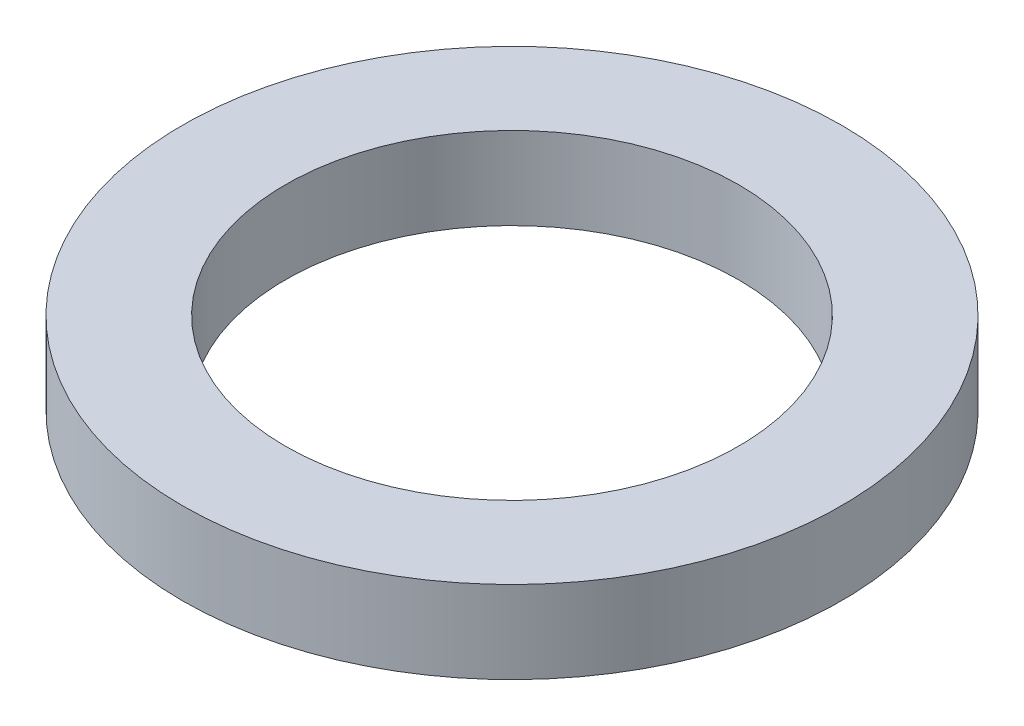
ISO-10303-21;
HEADER;
FILE_DESCRIPTION(('STEP AP214'),'2;1');
FILE_NAME('part.step','',(''),(''),'','','');
FILE_SCHEMA(('AUTOMOTIVE_DESIGN { 1 0 10303 214 1 1 1 1 }'));
ENDSEC;
DATA;
#1=APPLICATION_CONTEXT('core data for automotive mechanical design processes');
#2=APPLICATION_PROTOCOL_DEFINITION('international standard','automotive_design',2000,#1);
#3=PRODUCT_CONTEXT('',#1,'mechanical');
#4=PRODUCT('Part','Part','',(#3));
#5=PRODUCT_RELATED_PRODUCT_CATEGORY('part','',(#4));
#6=PRODUCT_DEFINITION_FORMATION('','',#4);
#7=PRODUCT_DEFINITION_CONTEXT('part definition',#1,'design');
#8=PRODUCT_DEFINITION('design','',#6,#7);
#9=PRODUCT_DEFINITION_SHAPE('','',#8);
#10=(LENGTH_UNIT() NAMED_UNIT(*) SI_UNIT(.MILLI.,.METRE.));
#11=(NAMED_UNIT(*) PLANE_ANGLE_UNIT() SI_UNIT($,.RADIAN.));
#12=(NAMED_UNIT(*) SI_UNIT($,.STERADIAN.) SOLID_ANGLE_UNIT());
#13=UNCERTAINTY_MEASURE_WITH_UNIT(LENGTH_MEASURE(1.E-05),#10,'distance_accuracy_value','');
#14=(GEOMETRIC_REPRESENTATION_CONTEXT(3) GLOBAL_UNCERTAINTY_ASSIGNED_CONTEXT((#13)) GLOBAL_UNIT_ASSIGNED_CONTEXT((#10,
#11,#12)) REPRESENTATION_CONTEXT('',''));
#15=CARTESIAN_POINT('',(0.,0.,0.));
#16=DIRECTION('',(0.,0.,1.));
#17=DIRECTION('',(1.,0.,0.));
#18=AXIS2_PLACEMENT_3D('',#15,#16,#17);
#19=CARTESIAN_POINT('',(0.,1.,0.));
#20=DIRECTION('',(0.,1.,0.));
#21=DIRECTION('',(0.,0.,1.));
#22=AXIS2_PLACEMENT_3D('',#19,#20,#21);
#23=PLANE('',#22);
#24=CARTESIAN_POINT('',(0.,1.,0.));
#25=DIRECTION('',(0.,1.,0.));
#26=DIRECTION('',(0.,0.,1.));
#27=AXIS2_PLACEMENT_3D('',#24,#25,#26);
#28=CIRCLE('',#27,4.);
#29=CARTESIAN_POINT('',(0.,1.,4.));
#30=VERTEX_POINT('',#29);
#31=EDGE_CURVE('E10',#30,#30,#28,.T.);
#32=ORIENTED_EDGE('',*,*,#31,.T.);
#33=EDGE_LOOP('',(#32));
#34=FACE_BOUND('',#33,.T.);
#35=CARTESIAN_POINT('',(0.,1.,0.));
#36=DIRECTION('',(0.,1.,0.));
#37=DIRECTION('',(0.,0.,1.));
#38=AXIS2_PLACEMENT_3D('',#35,#36,#37);
#39=CIRCLE('',#38,2.75);
#40=CARTESIAN_POINT('',(0.,1.,2.75));
#41=VERTEX_POINT('',#40);
#42=EDGE_CURVE('E45',#41,#41,#39,.T.);
#43=ORIENTED_EDGE('',*,*,#42,.F.);
#44=EDGE_LOOP('',(#43));
#45=FACE_BOUND('',#44,.T.);
#46=ADVANCED_FACE('F34',(#34,#45),#23,.T.);
#47=CARTESIAN_POINT('',(0.,0.,0.));
#48=DIRECTION('',(0.,1.,0.));
#49=DIRECTION('',(0.,0.,1.));
#50=AXIS2_PLACEMENT_3D('',#47,#48,#49);
#51=PLANE('',#50);
#52=CARTESIAN_POINT('',(0.,0.,0.));
#53=DIRECTION('',(0.,1.,0.));
#54=DIRECTION('',(0.,0.,1.));
#55=AXIS2_PLACEMENT_3D('',#52,#53,#54);
#56=CIRCLE('',#55,4.);
#57=CARTESIAN_POINT('',(0.,0.,4.));
#58=VERTEX_POINT('',#57);
#59=EDGE_CURVE('E38',#58,#58,#56,.T.);
#60=ORIENTED_EDGE('',*,*,#59,.F.);
#61=EDGE_LOOP('',(#60));
#62=FACE_BOUND('',#61,.T.);
#63=CARTESIAN_POINT('',(0.,0.,0.));
#64=DIRECTION('',(0.,1.,0.));
#65=DIRECTION('',(0.,0.,1.));
#66=AXIS2_PLACEMENT_3D('',#63,#64,#65);
#67=CIRCLE('',#66,2.75);
#68=CARTESIAN_POINT('',(0.,0.,2.75));
#69=VERTEX_POINT('',#68);
#70=EDGE_CURVE('E47',#69,#69,#67,.T.);
#71=ORIENTED_EDGE('',*,*,#70,.T.);
#72=EDGE_LOOP('',(#71));
#73=FACE_BOUND('',#72,.T.);
#74=ADVANCED_FACE('F57',(#62,#73),#51,.F.);
#75=CARTESIAN_POINT('',(0.,1.,0.));
#76=DIRECTION('',(0.,-1.,0.));
#77=DIRECTION('',(0.,0.,-1.));
#78=AXIS2_PLACEMENT_3D('',#75,#76,#77);
#79=CYLINDRICAL_SURFACE('',#78,4.);
#80=ORIENTED_EDGE('',*,*,#31,.F.);
#81=EDGE_LOOP('',(#80));
#82=FACE_BOUND('',#81,.T.);
#83=ORIENTED_EDGE('',*,*,#59,.T.);
#84=EDGE_LOOP('',(#83));
#85=FACE_BOUND('',#84,.T.);
#86=ADVANCED_FACE('F36',(#82,#85),#79,.T.);
#87=CARTESIAN_POINT('',(0.,1.,0.));
#88=DIRECTION('',(0.,-1.,0.));
#89=DIRECTION('',(0.,0.,-1.));
#90=AXIS2_PLACEMENT_3D('',#87,#88,#89);
#91=CYLINDRICAL_SURFACE('',#90,2.75);
#92=ORIENTED_EDGE('',*,*,#42,.T.);
#93=EDGE_LOOP('',(#92));
#94=FACE_BOUND('',#93,.T.);
#95=ORIENTED_EDGE('',*,*,#70,.F.);
#96=EDGE_LOOP('',(#95));
#97=FACE_BOUND('',#96,.T.);
#98=ADVANCED_FACE('F53',(#94,#97),#91,.F.);
#99=CLOSED_SHELL('',(#46,#74,#86,#98));
#100=MANIFOLD_SOLID_BREP('B2',#99);
#101=ADVANCED_BREP_SHAPE_REPRESENTATION('',(#18,#100),#14);
#102=SHAPE_DEFINITION_REPRESENTATION(#9,#101);
ENDSEC;
END-ISO-10303-21;
